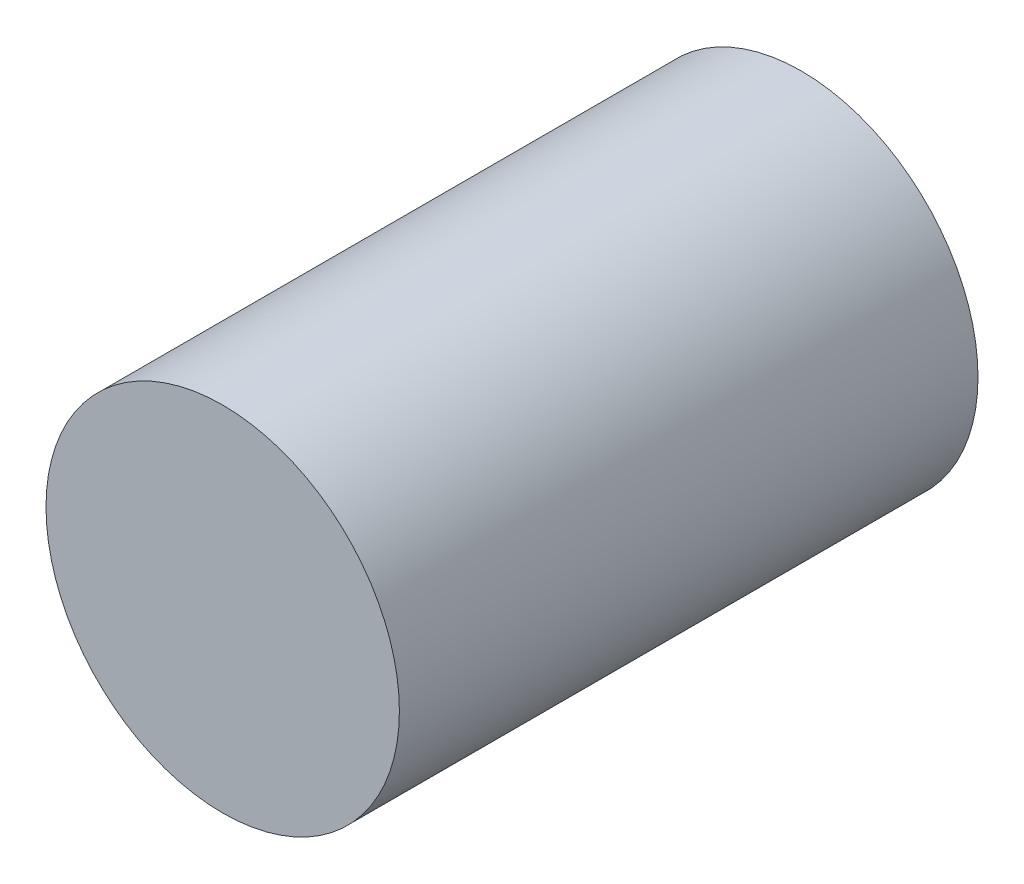
ISO-10303-21;
HEADER;
FILE_DESCRIPTION(('STEP AP214'),'2;1');
FILE_NAME('part.step','',(''),(''),'','','');
FILE_SCHEMA(('AUTOMOTIVE_DESIGN { 1 0 10303 214 1 1 1 1 }'));
ENDSEC;
DATA;
#1=APPLICATION_CONTEXT('core data for automotive mechanical design processes');
#2=APPLICATION_PROTOCOL_DEFINITION('international standard','automotive_design',2000,#1);
#3=PRODUCT_CONTEXT('',#1,'mechanical');
#4=PRODUCT('Part','Part','',(#3));
#5=PRODUCT_RELATED_PRODUCT_CATEGORY('part','',(#4));
#6=PRODUCT_DEFINITION_FORMATION('','',#4);
#7=PRODUCT_DEFINITION_CONTEXT('part definition',#1,'design');
#8=PRODUCT_DEFINITION('design','',#6,#7);
#9=PRODUCT_DEFINITION_SHAPE('','',#8);
#10=(LENGTH_UNIT() NAMED_UNIT(*) SI_UNIT(.MILLI.,.METRE.));
#11=(NAMED_UNIT(*) PLANE_ANGLE_UNIT() SI_UNIT($,.RADIAN.));
#12=(NAMED_UNIT(*) SI_UNIT($,.STERADIAN.) SOLID_ANGLE_UNIT());
#13=UNCERTAINTY_MEASURE_WITH_UNIT(LENGTH_MEASURE(1.E-05),#10,'distance_accuracy_value','');
#14=(GEOMETRIC_REPRESENTATION_CONTEXT(3) GLOBAL_UNCERTAINTY_ASSIGNED_CONTEXT((#13)) GLOBAL_UNIT_ASSIGNED_CONTEXT((#10,
#11,#12)) REPRESENTATION_CONTEXT('',''));
#15=CARTESIAN_POINT('',(0.,0.,0.));
#16=DIRECTION('',(0.,0.,1.));
#17=DIRECTION('',(1.,0.,0.));
#18=AXIS2_PLACEMENT_3D('',#15,#16,#17);
#19=CARTESIAN_POINT('',(0.,0.,93.));
#20=DIRECTION('',(0.,0.,-1.));
#21=DIRECTION('',(-1.,0.,0.));
#22=AXIS2_PLACEMENT_3D('',#19,#20,#21);
#23=CYLINDRICAL_SURFACE('',#22,28.4);
#24=CARTESIAN_POINT('',(0.,0.,93.));
#25=DIRECTION('',(0.,0.,1.));
#26=DIRECTION('',(1.,0.,0.));
#27=AXIS2_PLACEMENT_3D('',#24,#25,#26);
#28=CIRCLE('',#27,28.4);
#29=CARTESIAN_POINT('',(28.4,0.,93.));
#30=VERTEX_POINT('',#29);
#31=EDGE_CURVE('E10',#30,#30,#28,.T.);
#32=ORIENTED_EDGE('',*,*,#31,.F.);
#33=EDGE_LOOP('',(#32));
#34=FACE_BOUND('',#33,.T.);
#35=CARTESIAN_POINT('',(0.,0.,0.));
#36=DIRECTION('',(0.,0.,1.));
#37=DIRECTION('',(1.,0.,0.));
#38=AXIS2_PLACEMENT_3D('',#35,#36,#37);
#39=CIRCLE('',#38,28.4);
#40=CARTESIAN_POINT('',(28.4,0.,0.));
#41=VERTEX_POINT('',#40);
#42=EDGE_CURVE('E33',#41,#41,#39,.T.);
#43=ORIENTED_EDGE('',*,*,#42,.T.);
#44=EDGE_LOOP('',(#43));
#45=FACE_BOUND('',#44,.T.);
#46=ADVANCED_FACE('F30',(#34,#45),#23,.T.);
#47=CARTESIAN_POINT('',(0.,0.,93.));
#48=DIRECTION('',(0.,0.,1.));
#49=DIRECTION('',(1.,0.,0.));
#50=AXIS2_PLACEMENT_3D('',#47,#48,#49);
#51=PLANE('',#50);
#52=ORIENTED_EDGE('',*,*,#31,.T.);
#53=EDGE_LOOP('',(#52));
#54=FACE_BOUND('',#53,.T.);
#55=ADVANCED_FACE('F45',(#54),#51,.T.);
#56=CARTESIAN_POINT('',(0.,0.,0.));
#57=DIRECTION('',(0.,0.,1.));
#58=DIRECTION('',(1.,0.,0.));
#59=AXIS2_PLACEMENT_3D('',#56,#57,#58);
#60=PLANE('',#59);
#61=ORIENTED_EDGE('',*,*,#42,.F.);
#62=EDGE_LOOP('',(#61));
#63=FACE_BOUND('',#62,.T.);
#64=ADVANCED_FACE('F43',(#63),#60,.F.);
#65=CLOSED_SHELL('',(#46,#55,#64));
#66=MANIFOLD_SOLID_BREP('B2',#65);
#67=ADVANCED_BREP_SHAPE_REPRESENTATION('',(#18,#66),#14);
#68=SHAPE_DEFINITION_REPRESENTATION(#9,#67);
ENDSEC;
END-ISO-10303-21;
